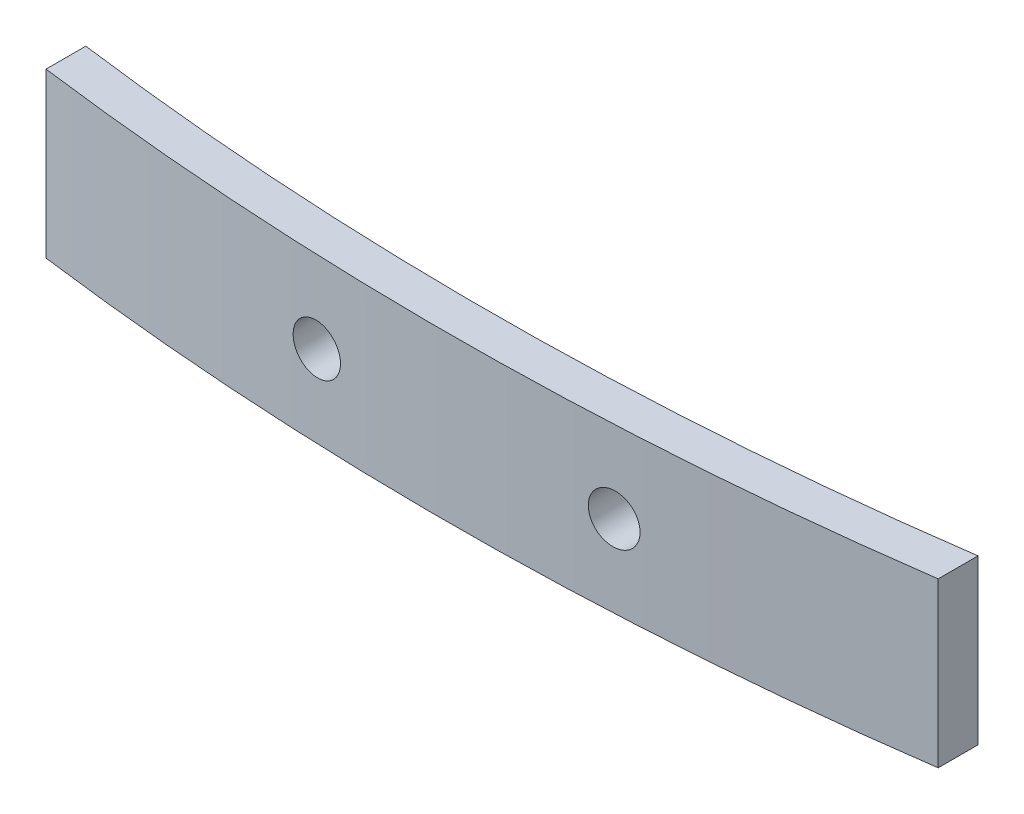
ISO-10303-21;
HEADER;
FILE_DESCRIPTION(('STEP AP214'),'2;1');
FILE_NAME('part.step','',(''),(''),'','','');
FILE_SCHEMA(('AUTOMOTIVE_DESIGN { 1 0 10303 214 1 1 1 1 }'));
ENDSEC;
DATA;
#1=APPLICATION_CONTEXT('core data for automotive mechanical design processes');
#2=APPLICATION_PROTOCOL_DEFINITION('international standard','automotive_design',2000,#1);
#3=PRODUCT_CONTEXT('',#1,'mechanical');
#4=PRODUCT('Part','Part','',(#3));
#5=PRODUCT_RELATED_PRODUCT_CATEGORY('part','',(#4));
#6=PRODUCT_DEFINITION_FORMATION('','',#4);
#7=PRODUCT_DEFINITION_CONTEXT('part definition',#1,'design');
#8=PRODUCT_DEFINITION('design','',#6,#7);
#9=PRODUCT_DEFINITION_SHAPE('','',#8);
#10=(LENGTH_UNIT() NAMED_UNIT(*) SI_UNIT(.MILLI.,.METRE.));
#11=(NAMED_UNIT(*) PLANE_ANGLE_UNIT() SI_UNIT($,.RADIAN.));
#12=(NAMED_UNIT(*) SI_UNIT($,.STERADIAN.) SOLID_ANGLE_UNIT());
#13=UNCERTAINTY_MEASURE_WITH_UNIT(LENGTH_MEASURE(1.E-05),#10,'distance_accuracy_value','');
#14=(GEOMETRIC_REPRESENTATION_CONTEXT(3) GLOBAL_UNCERTAINTY_ASSIGNED_CONTEXT((#13)) GLOBAL_UNIT_ASSIGNED_CONTEXT((#10,
#11,#12)) REPRESENTATION_CONTEXT('',''));
#15=CARTESIAN_POINT('',(0.,0.,0.));
#16=DIRECTION('',(0.,0.,1.));
#17=DIRECTION('',(1.,0.,0.));
#18=AXIS2_PLACEMENT_3D('',#15,#16,#17);
#19=CARTESIAN_POINT('',(-0.864955357142889,8.3,-164.510629845203));
#20=DIRECTION('',(0.,-1.,0.));
#21=DIRECTION('',(0.,0.,-1.));
#22=AXIS2_PLACEMENT_3D('',#19,#20,#21);
#23=CYLINDRICAL_SURFACE('',#22,165.210703971618);
#24=CARTESIAN_POINT('',(8.75,4.15,0.420050564105906));
#25=CARTESIAN_POINT('',(8.7499968756701,4.22012785151778,0.420050786641416));
#26=CARTESIAN_POINT('',(8.74407852912759,4.29030657591266,0.420396098331581));
#27=CARTESIAN_POINT('',(8.72055304510893,4.42872948848566,0.421764998652098));
#28=CARTESIAN_POINT('',(8.70293184075388,4.49697124536185,0.422789403552305));
#29=CARTESIAN_POINT('',(8.65650809093418,4.62949303841441,0.425475899042392));
#30=CARTESIAN_POINT('',(8.62771132313101,4.69377510184941,0.427137660119919));
#31=CARTESIAN_POINT('',(8.55976687690109,4.81657159404113,0.431033993499507));
#32=CARTESIAN_POINT('',(8.52062172919151,4.87508742814449,0.433268425749608));
#33=CARTESIAN_POINT('',(8.43305223614725,4.98477091182553,0.438227928441564));
#34=CARTESIAN_POINT('',(8.38461943762333,5.0359317924697,0.440953445708678));
#35=CARTESIAN_POINT('',(8.27987264209871,5.12940091687988,0.446793671892669));
#36=CARTESIAN_POINT('',(8.22355827497798,5.17170874467183,0.449908399086186));
#37=CARTESIAN_POINT('',(8.10455421106636,5.24633687235545,0.456421883334665));
#38=CARTESIAN_POINT('',(8.04185485362085,5.27864172993917,0.459821069355648));
#39=CARTESIAN_POINT('',(7.91193085692122,5.3322656283006,0.466784376452273));
#40=CARTESIAN_POINT('',(7.84470619336023,5.35358461006432,0.470348498413806));
#41=CARTESIAN_POINT('',(7.70755407236171,5.38465422269091,0.47753187341042));
#42=CARTESIAN_POINT('',(7.63762353654749,5.39439125228122,0.481151186219383));
#43=CARTESIAN_POINT('',(7.49711770071093,5.40197506678777,0.488331935567919));
#44=CARTESIAN_POINT('',(7.42654240018963,5.39982184250167,0.491893372062698));
#45=CARTESIAN_POINT('',(7.28673057784616,5.38368125095752,0.498859654116249));
#46=CARTESIAN_POINT('',(7.2174944251081,5.36969066742186,0.50226445685162));
#47=CARTESIAN_POINT('',(7.0823491009662,5.33026368881494,0.508828518634869));
#48=CARTESIAN_POINT('',(7.01643992557216,5.30482730747152,0.511987777977241));
#49=CARTESIAN_POINT('',(6.8898629668437,5.24324445263167,0.517984389992272));
#50=CARTESIAN_POINT('',(6.82919212444487,5.20710428528416,0.520821930848433));
#51=CARTESIAN_POINT('',(6.71477797427487,5.12513018115386,0.526116471355506));
#52=CARTESIAN_POINT('',(6.66103462822729,5.07929629793533,0.52857347310902));
#53=CARTESIAN_POINT('',(6.56206132205862,4.97928608662616,0.533057060848424));
#54=CARTESIAN_POINT('',(6.51682265931467,4.92511839069348,0.535084087092821));
#55=CARTESIAN_POINT('',(6.43608202244562,4.80994284773568,0.538675511251535));
#56=CARTESIAN_POINT('',(6.40057999610528,4.74893503739491,0.540239911646806));
#57=CARTESIAN_POINT('',(6.340357933409,4.62187706871117,0.542879900415455));
#58=CARTESIAN_POINT('',(6.31562712260273,4.55583202720676,0.543955977304391));
#59=CARTESIAN_POINT('',(6.27760214546197,4.42052190669178,0.545605857793076));
#60=CARTESIAN_POINT('',(6.26430793152615,4.35125684108483,0.546179663483375));
#61=CARTESIAN_POINT('',(6.24954097440456,4.21152203853996,0.546816834887879));
#62=CARTESIAN_POINT('',(6.24806041369155,4.14105312917926,0.546880538155648));
#63=CARTESIAN_POINT('',(6.25694243045685,4.00086716847885,0.546497531082771));
#64=CARTESIAN_POINT('',(6.26730498629387,3.93115011576549,0.546050821674816));
#65=CARTESIAN_POINT('',(6.29957441132196,3.79445965589939,0.544653251256617));
#66=CARTESIAN_POINT('',(6.3214792062226,3.72748575809605,0.543702480832502));
#67=CARTESIAN_POINT('',(6.37620694922726,3.59816781419316,0.541310528570389));
#68=CARTESIAN_POINT('',(6.40902990399195,3.5358237709181,0.539869346433213));
#69=CARTESIAN_POINT('',(6.48467114761501,3.4175119277289,0.536518343609078));
#70=CARTESIAN_POINT('',(6.52749274492063,3.36154624749035,0.534608367792417));
#71=CARTESIAN_POINT('',(6.62190587875572,3.25759845060247,0.530352467316842));
#72=CARTESIAN_POINT('',(6.6734974488955,3.2096163645511,0.528006540987174));
#73=CARTESIAN_POINT('',(6.78402732919472,3.1229563323932,0.522920767674274));
#74=CARTESIAN_POINT('',(6.8429713797798,3.08428572609344,0.520180612638965));
#75=CARTESIAN_POINT('',(6.96649912462997,3.01738774672038,0.51436476411554));
#76=CARTESIAN_POINT('',(7.03108284432829,2.98916042074618,0.511289069114225));
#77=CARTESIAN_POINT('',(7.16412839034453,2.94391857326429,0.504869298035268));
#78=CARTESIAN_POINT('',(7.23259422327701,2.92691587381022,0.501524943142095));
#79=CARTESIAN_POINT('',(7.37140001377697,2.90464748821122,0.494654869625039));
#80=CARTESIAN_POINT('',(7.44173998602875,2.89938189405638,0.491129149579919));
#81=CARTESIAN_POINT('',(7.58236818374903,2.90073434853974,0.483989440786617));
#82=CARTESIAN_POINT('',(7.65265629683359,2.90736367487349,0.480375371478415));
#83=CARTESIAN_POINT('',(7.79112055707237,2.9323391674771,0.473168949725147));
#84=CARTESIAN_POINT('',(7.85929669259729,2.95068539825232,0.469576597399751));
#85=CARTESIAN_POINT('',(7.99162839490877,2.99858567305698,0.462525628244137));
#86=CARTESIAN_POINT('',(8.05578240324823,3.02814403053687,0.459067063448728));
#87=CARTESIAN_POINT('',(8.17821506459887,3.09763191261792,0.452400980172807));
#88=CARTESIAN_POINT('',(8.23649395687128,3.13756101463856,0.449193451470163));
#89=CARTESIAN_POINT('',(8.34548259383017,3.22663160990741,0.44314404983962));
#90=CARTESIAN_POINT('',(8.39619733991694,3.27576696706239,0.440301935473492));
#91=CARTESIAN_POINT('',(8.4886680570718,3.38189249727254,0.435084215694027));
#92=CARTESIAN_POINT('',(8.5304218580004,3.43888456757103,0.432708723297817));
#93=CARTESIAN_POINT('',(8.60372478212185,3.55903320833602,0.428516976642923));
#94=CARTESIAN_POINT('',(8.6352829269122,3.62218426425832,0.426700228050152));
#95=CARTESIAN_POINT('',(8.68731128395109,3.75285295151056,0.423695249568868));
#96=CARTESIAN_POINT('',(8.70779492398493,3.82036518318595,0.422506258568424));
#97=CARTESIAN_POINT('',(8.73161237551989,3.93192617529781,0.421121713201919));
#98=CARTESIAN_POINT('',(8.73849904429465,3.97524605096882,0.420720697745676));
#99=CARTESIAN_POINT('',(8.74769383053028,4.06237066227353,0.420185053794028));
#100=CARTESIAN_POINT('',(8.75000195246986,4.1061753974329,0.420050425038045));
#101=CARTESIAN_POINT('',(8.75,4.15,0.420050564105906));
#102=B_SPLINE_CURVE_WITH_KNOTS('',3,(#24,#25,#26,#27,#28,#29,#30,#31,#32,#33,#34,#35,#36,#37,
#38,#39,#40,#41,#42,#43,#44,#45,#46,#47,#48,#49,#50,#51,#52,#53,#54,#55,#56,#57,#58,#59,#60,#61,
#62,#63,#64,#65,#66,#67,#68,#69,#70,#71,#72,#73,#74,#75,#76,#77,#78,#79,#80,#81,#82,#83,#84,#85,
#86,#87,#88,#89,#90,#91,#92,#93,#94,#95,#96,#97,#98,#99,#100,#101),.UNSPECIFIED.,.T.,.F.,(4,2,2,
2,2,2,2,2,2,2,2,2,2,2,2,2,2,2,2,2,2,2,2,2,2,2,2,2,2,2,2,2,2,2,2,2,2,2,4),(0.,0.210223445977021,
0.420700039769353,0.631067963784939,0.841384489415681,1.0518933518043,1.26241210304977,
1.47325424539596,1.68409752033319,1.89518815550945,2.10627895405728,2.31742712559702,
2.52857504389096,2.73959881074264,2.95062141157759,3.16142688888051,3.37223123566221,
3.58282422776111,3.79341634332708,4.00386909080652,4.21432145372016,4.42473600850072,
4.63515069164558,4.84563509774261,5.05612031052455,5.26677089982141,5.47742243913898,
5.68829548939093,5.89917019236428,6.11024493345311,6.32132083658665,6.53247802584897,
6.74362661236154,6.95463496292118,7.16569435743921,7.37656648187793,7.58718234815398,
7.71855622861525,7.84992998056732),.UNSPECIFIED.);
#103=CARTESIAN_POINT('',(8.75,4.15,0.420050564105906));
#104=VERTEX_POINT('',#103);
#105=EDGE_CURVE('E120',#104,#104,#102,.T.);
#106=ORIENTED_EDGE('',*,*,#105,.T.);
#107=EDGE_LOOP('',(#106));
#108=FACE_BOUND('',#107,.T.);
#109=CARTESIAN_POINT('',(-6.25,4.15,0.612288009926604));
#110=CARTESIAN_POINT('',(-6.25000311571131,4.22018355239191,0.612287948701828));
#111=CARTESIAN_POINT('',(-6.25593075978931,4.2904179787371,0.612094924403045));
#112=CARTESIAN_POINT('',(-6.27949447756528,4.42895209563306,0.611323893589454));
#113=CARTESIAN_POINT('',(-6.2971446367521,4.49724935546489,0.610745423930159));
#114=CARTESIAN_POINT('',(-6.34364908837448,4.62988168369549,0.609208938538244));
#115=CARTESIAN_POINT('',(-6.37249792853421,4.69421866259394,0.60825110749982));
#116=CARTESIAN_POINT('',(-6.44057119968027,4.81711670051832,0.605966440329405));
#117=CARTESIAN_POINT('',(-6.47979305791574,4.87567918681573,0.60463969569242));
#118=CARTESIAN_POINT('',(-6.56751337852462,4.9854062839793,0.601633356485878));
#119=CARTESIAN_POINT('',(-6.61601467183209,5.03656862885316,0.599953654221964));
#120=CARTESIAN_POINT('',(-6.72090916987377,5.13002658482638,0.596266618886532));
#121=CARTESIAN_POINT('',(-6.77730270118661,5.17232182882653,0.594259272256609));
#122=CARTESIAN_POINT('',(-6.89640796884524,5.24686589631549,0.589951115896844));
#123=CARTESIAN_POINT('',(-6.95912282670767,5.27910972386023,0.587650161030504));
#124=CARTESIAN_POINT('',(-7.08906630444559,5.3326117277739,0.582802406813894));
#125=CARTESIAN_POINT('',(-7.15629493167516,5.35386988624392,0.580255607063078));
#126=CARTESIAN_POINT('',(-7.29340442194187,5.38481197096959,0.574973575011229));
#127=CARTESIAN_POINT('',(-7.36328700154222,5.39448826991545,0.572238219788182));
#128=CARTESIAN_POINT('',(-7.50368007668842,5.4019696691906,0.56665198267269));
#129=CARTESIAN_POINT('',(-7.57419057342636,5.39977474697769,0.563801100560882));
#130=CARTESIAN_POINT('',(-7.71387945362295,5.38357292521863,0.558064449045412));
#131=CARTESIAN_POINT('',(-7.78305707886924,5.36955949439595,0.555178661221106));
#132=CARTESIAN_POINT('',(-7.91807733611011,5.33010934361725,0.549464502868027));
#133=CARTESIAN_POINT('',(-7.98391995872912,5.30467259154922,0.546636132500682));
#134=CARTESIAN_POINT('',(-8.11040870949573,5.24309180134629,0.54113211185841));
#135=CARTESIAN_POINT('',(-8.17105421102282,5.20694647440621,0.538456480012221));
#136=CARTESIAN_POINT('',(-8.28541568787778,5.12497267595302,0.533354465386389));
#137=CARTESIAN_POINT('',(-8.33913167949136,5.07914422719782,0.530928082020964));
#138=CARTESIAN_POINT('',(-8.43807894852099,4.97912832988149,0.526417399872258));
#139=CARTESIAN_POINT('',(-8.48331455816759,4.92494517527411,0.524332926491592));
#140=CARTESIAN_POINT('',(-8.56404495416109,4.80973912005988,0.520586488920757));
#141=CARTESIAN_POINT('',(-8.59953979122227,4.74871625506557,0.518924522530854));
#142=CARTESIAN_POINT('',(-8.65974439972634,4.6216271240783,0.516091877374447));
#143=CARTESIAN_POINT('',(-8.68446475412751,4.55556588220122,0.514920716570525));
#144=CARTESIAN_POINT('',(-8.72246441910089,4.42022399273247,0.513115788962741));
#145=CARTESIAN_POINT('',(-8.73574379707123,4.35094336410855,0.512482018993142));
#146=CARTESIAN_POINT('',(-8.75047458862379,4.2111980915843,0.511778780959092));
#147=CARTESIAN_POINT('',(-8.75193694008761,4.14073460310762,0.511708791058003));
#148=CARTESIAN_POINT('',(-8.74302066539331,4.0005626973153,0.512134684324352));
#149=CARTESIAN_POINT('',(-8.73264207065434,3.93085427799663,0.512630565990288));
#150=CARTESIAN_POINT('',(-8.70034544962065,3.79419204857333,0.514167162544728));
#151=CARTESIAN_POINT('',(-8.67843080347073,3.7272374377756,0.515207717839497));
#152=CARTESIAN_POINT('',(-8.62368951853576,3.59795898046812,0.517790426931301));
#153=CARTESIAN_POINT('',(-8.5908628581906,3.5356351431082,0.519332581719403));
#154=CARTESIAN_POINT('',(-8.51521227384373,3.41735055124752,0.522856772119375));
#155=CARTESIAN_POINT('',(-8.47238306461757,3.36139318403883,0.524839040254345));
#156=CARTESIAN_POINT('',(-8.3779548356778,3.25746147580423,0.52916466983499));
#157=CARTESIAN_POINT('',(-8.32635576524137,3.20948718095373,0.53150803336915));
#158=CARTESIAN_POINT('',(-8.21579579794787,3.12283180802716,0.536469223168007));
#159=CARTESIAN_POINT('',(-8.15682751540769,3.08416016875794,0.539087324356433));
#160=CARTESIAN_POINT('',(-8.03324331961947,3.01726497292627,0.544500869169606));
#161=CARTESIAN_POINT('',(-7.96862738257522,2.98904146038931,0.547296313541571));
#162=CARTESIAN_POINT('',(-7.8355196571947,2.94381943465548,0.552971163005119));
#163=CARTESIAN_POINT('',(-7.76702449530367,2.92683085980956,0.555850640087178));
#164=CARTESIAN_POINT('',(-7.62815314481567,2.90459979079998,0.561598861621527));
#165=CARTESIAN_POINT('',(-7.55777694822369,2.89935734656927,0.564467606028139));
#166=CARTESIAN_POINT('',(-7.41711753048462,2.90076871395252,0.570110501825143));
#167=CARTESIAN_POINT('',(-7.34683434598474,2.90742630602083,0.572884622869854));
#168=CARTESIAN_POINT('',(-7.20837958754747,2.93245878709451,0.578262808404097));
#169=CARTESIAN_POINT('',(-7.14020801585102,2.95083368853438,0.580866872713159));
#170=CARTESIAN_POINT('',(-7.00793228027882,2.99877590873363,0.58584172349279));
#171=CARTESIAN_POINT('',(-6.94382705094201,3.02834028137105,0.588212571161087));
#172=CARTESIAN_POINT('',(-6.82149085700398,3.09782436801472,0.592671585008922));
#173=CARTESIAN_POINT('',(-6.76325964443876,3.13774364464784,0.59475976312226));
#174=CARTESIAN_POINT('',(-6.65436671082572,3.22677356012875,0.598613974910899));
#175=CARTESIAN_POINT('',(-6.60369956033725,3.27587754864781,0.600380239856701));
#176=CARTESIAN_POINT('',(-6.51131557625305,3.38191903380727,0.603565383454531));
#177=CARTESIAN_POINT('',(-6.46960094041181,3.43885844835036,0.604984176817734));
#178=CARTESIAN_POINT('',(-6.39633408535729,3.55892548464134,0.607454882195929));
#179=CARTESIAN_POINT('',(-6.36478028832285,3.62205214361811,0.60850685117518));
#180=CARTESIAN_POINT('',(-6.31275419768299,3.75266197816612,0.610231582461445));
#181=CARTESIAN_POINT('',(-6.29226858560104,3.82013980793337,0.610904800564298));
#182=CARTESIAN_POINT('',(-6.26842481149668,3.93170707646447,0.611686340087224));
#183=CARTESIAN_POINT('',(-6.26152415895528,3.9750705609376,0.61191184300066));
#184=CARTESIAN_POINT('',(-6.25231078003501,4.06228273831287,0.612212697036008));
#185=CARTESIAN_POINT('',(-6.24999805250957,4.10613143109375,0.612288048195446));
#186=CARTESIAN_POINT('',(-6.25,4.15,0.612288009926604));
#187=B_SPLINE_CURVE_WITH_KNOTS('',3,(#109,#110,#111,#112,#113,#114,#115,#116,#117,#118,#119,
#120,#121,#122,#123,#124,#125,#126,#127,#128,#129,#130,#131,#132,#133,#134,#135,#136,#137,#138,
#139,#140,#141,#142,#143,#144,#145,#146,#147,#148,#149,#150,#151,#152,#153,#154,#155,#156,#157,
#158,#159,#160,#161,#162,#163,#164,#165,#166,#167,#168,#169,#170,#171,#172,#173,#174,#175,#176,
#177,#178,#179,#180,#181,#182,#183,#184,#185,#186),.UNSPECIFIED.,.T.,.F.,(4,2,2,2,2,2,2,2,2,2,2,
2,2,2,2,2,2,2,2,2,2,2,2,2,2,2,2,2,2,2,2,2,2,2,2,2,2,2,4),(0.,0.210390503068588,
0.421034264711717,0.631575599082519,0.842064763174761,1.05261824517612,1.26318044240039,
1.47384713095046,1.68451416273795,1.89531985448584,2.10612594653145,2.3170486129942,
2.52797187238342,2.7389205272615,2.94986868635966,3.16070878649296,3.3715477888891,
3.58217923083019,3.79280943194546,4.00324465064315,4.21367931096638,4.42405234673518,
4.63442579816419,4.84491066085422,5.05539674098095,5.26609549541984,5.47679513767428,
5.6876809150019,5.89856758880574,6.10952126989617,6.32047517485255,6.53137357548215,
6.74226306958042,6.95300045295797,7.1637895112675,7.37454582149352,7.58504795814686,
7.71655359263121,7.8480591942506),.UNSPECIFIED.);
#188=CARTESIAN_POINT('',(-6.25,4.15,0.612288009926604));
#189=VERTEX_POINT('',#188);
#190=EDGE_CURVE('E137',#189,#189,#187,.T.);
#191=ORIENTED_EDGE('',*,*,#190,.T.);
#192=EDGE_LOOP('',(#191));
#193=FACE_BOUND('',#192,.T.);
#194=CARTESIAN_POINT('',(-0.864955357142889,0.,-164.510629845203));
#195=DIRECTION('',(0.,-1.,0.));
#196=DIRECTION('',(0.,0.,1.));
#197=AXIS2_PLACEMENT_3D('',#194,#195,#196);
#198=CIRCLE('',#197,165.210703971618);
#199=CARTESIAN_POINT('',(22.5,0.,-0.960467607569709));
#200=VERTEX_POINT('',#199);
#201=CARTESIAN_POINT('',(-22.5,0.,-0.722652416763447));
#202=VERTEX_POINT('',#201);
#203=EDGE_CURVE('E116',#200,#202,#198,.T.);
#204=ORIENTED_EDGE('',*,*,#203,.T.);
#205=DIRECTION('',(0.,-1.,0.));
#206=VECTOR('',#205,1.);
#207=CARTESIAN_POINT('',(-22.5,8.3,-0.722652416763447));
#208=LINE('',#207,#206);
#209=CARTESIAN_POINT('',(-22.5,8.3,-0.722652416763447));
#210=VERTEX_POINT('',#209);
#211=EDGE_CURVE('E11',#210,#202,#208,.T.);
#212=ORIENTED_EDGE('',*,*,#211,.F.);
#213=CARTESIAN_POINT('',(-0.864955357142889,8.3,-164.510629845203));
#214=DIRECTION('',(0.,-1.,0.));
#215=DIRECTION('',(0.,0.,1.));
#216=AXIS2_PLACEMENT_3D('',#213,#214,#215);
#217=CIRCLE('',#216,165.210703971618);
#218=CARTESIAN_POINT('',(22.5,8.3,-0.960467607569709));
#219=VERTEX_POINT('',#218);
#220=EDGE_CURVE('E99',#219,#210,#217,.T.);
#221=ORIENTED_EDGE('',*,*,#220,.F.);
#222=DIRECTION('',(0.,-1.,0.));
#223=VECTOR('',#222,1.);
#224=CARTESIAN_POINT('',(22.5,8.3,-0.960467607569709));
#225=LINE('',#224,#223);
#226=EDGE_CURVE('E112',#219,#200,#225,.T.);
#227=ORIENTED_EDGE('',*,*,#226,.T.);
#228=EDGE_LOOP('',(#204,#212,#221,#227));
#229=FACE_BOUND('',#228,.T.);
#230=ADVANCED_FACE('F39',(#108,#193,#229),#23,.F.);
#231=CARTESIAN_POINT('',(-22.5,8.3,-0.722652416763447));
#232=DIRECTION('',(1.,0.,0.));
#233=DIRECTION('',(0.,0.,-1.));
#234=AXIS2_PLACEMENT_3D('',#231,#232,#233);
#235=PLANE('',#234);
#236=DIRECTION('',(0.,0.,1.));
#237=VECTOR('',#236,1.);
#238=CARTESIAN_POINT('',(-22.5,0.,-0.722652416763447));
#239=LINE('',#238,#237);
#240=CARTESIAN_POINT('',(-22.5000000000001,0.,1.29450990017857));
#241=VERTEX_POINT('',#240);
#242=EDGE_CURVE('E104',#202,#241,#239,.T.);
#243=ORIENTED_EDGE('',*,*,#242,.T.);
#244=DIRECTION('',(0.,-1.,0.));
#245=VECTOR('',#244,1.);
#246=CARTESIAN_POINT('',(-22.5000000000001,8.3,1.29450990017857));
#247=LINE('',#246,#245);
#248=CARTESIAN_POINT('',(-22.5000000000001,8.3,1.29450990017857));
#249=VERTEX_POINT('',#248);
#250=EDGE_CURVE('E55',#249,#241,#247,.T.);
#251=ORIENTED_EDGE('',*,*,#250,.F.);
#252=DIRECTION('',(0.,0.,1.));
#253=VECTOR('',#252,1.);
#254=CARTESIAN_POINT('',(-22.5,8.3,-0.722652416763447));
#255=LINE('',#254,#253);
#256=EDGE_CURVE('E94',#210,#249,#255,.T.);
#257=ORIENTED_EDGE('',*,*,#256,.F.);
#258=ORIENTED_EDGE('',*,*,#211,.T.);
#259=EDGE_LOOP('',(#243,#251,#257,#258));
#260=FACE_BOUND('',#259,.T.);
#261=ADVANCED_FACE('F103',(#260),#235,.F.);
#262=CARTESIAN_POINT('',(-0.864955357142889,8.3,-164.510629845203));
#263=DIRECTION('',(0.,-1.,0.));
#264=DIRECTION('',(0.,0.,-1.));
#265=AXIS2_PLACEMENT_3D('',#262,#263,#264);
#266=CYLINDRICAL_SURFACE('',#265,167.210703971618);
#267=CARTESIAN_POINT('',(8.75,4.15,2.42340549859404));
#268=CARTESIAN_POINT('',(8.7499968759262,4.07987012137044,2.42340571844586));
#269=CARTESIAN_POINT('',(8.74407819084325,4.00968936898739,2.42374690560115));
#270=CARTESIAN_POINT('',(8.72055131717487,3.87126241398294,2.42509945786627));
#271=CARTESIAN_POINT('',(8.70292906080826,3.80301864269076,2.42611162950184));
#272=CARTESIAN_POINT('',(8.65650238633006,3.67049285173357,2.4287660522962));
#273=CARTESIAN_POINT('',(8.62770373590653,3.60620880840686,2.43040797845888));
#274=CARTESIAN_POINT('',(8.55975462355993,3.48340863823658,2.43425781776976));
#275=CARTESIAN_POINT('',(8.52060669359667,3.42489110541184,2.43646559247862));
#276=CARTESIAN_POINT('',(8.43303156162517,3.31520582991078,2.44136589382248));
#277=CARTESIAN_POINT('',(8.38459608361104,3.26404471412625,2.44405885266811));
#278=CARTESIAN_POINT('',(8.27984339346623,3.17057563894572,2.44982931904001));
#279=CARTESIAN_POINT('',(8.22352581262794,3.12826809393164,2.45290684455476));
#280=CARTESIAN_POINT('',(8.10451714174231,3.05364269118637,2.45934241559074));
#281=CARTESIAN_POINT('',(8.041816623435,3.02133990455394,2.46270087473628));
#282=CARTESIAN_POINT('',(7.91189047346441,2.96772029239522,2.46958074239435));
#283=CARTESIAN_POINT('',(7.84466481828969,2.9464035239544,2.4731021517535));
#284=CARTESIAN_POINT('',(7.70751294966958,2.91533895910661,2.48019932744157));
#285=CARTESIAN_POINT('',(7.63758373153518,2.90560444024127,2.48377515140502));
#286=CARTESIAN_POINT('',(7.49708099898386,2.89802511241837,2.49086960284267));
#287=CARTESIAN_POINT('',(7.42650748410816,2.90018031192793,2.49438823027613));
#288=CARTESIAN_POINT('',(7.28670012554887,2.91632414244071,2.50127073842057));
#289=CARTESIAN_POINT('',(7.21746664220022,2.93031591229712,2.50463457783493));
#290=CARTESIAN_POINT('',(7.08232692497333,2.96974430691074,2.51111965594278));
#291=CARTESIAN_POINT('',(7.01642068728273,2.99518091855414,2.51424089491422));
#292=CARTESIAN_POINT('',(6.88984875734409,3.05676359416933,2.520165375863));
#293=CARTESIAN_POINT('',(6.82918007858731,3.09290350222251,2.52296879935137));
#294=CARTESIAN_POINT('',(6.71477020629758,3.17487622745391,2.52819967652553));
#295=CARTESIAN_POINT('',(6.66102897533549,3.22070899225789,2.53062713224269));
#296=CARTESIAN_POINT('',(6.56205835230829,3.32071733576925,2.53505686160251));
#297=CARTESIAN_POINT('',(6.51682046506705,3.37488448861664,2.5370595598542));
#298=CARTESIAN_POINT('',(6.43608126204884,3.49005848772344,2.54060787994089));
#299=CARTESIAN_POINT('',(6.40057989533456,3.55106529819833,2.54215350416711));
#300=CARTESIAN_POINT('',(6.34035812216982,3.67812241017294,2.54476184415459));
#301=CARTESIAN_POINT('',(6.31562719806153,3.7441677170099,2.545825031073));
#302=CARTESIAN_POINT('',(6.2776020971927,3.87947825233901,2.54745514622849));
#303=CARTESIAN_POINT('',(6.26430787395331,3.94874346774423,2.54802207648237));
#304=CARTESIAN_POINT('',(6.24954082405741,4.08847961995922,2.54865161672816));
#305=CARTESIAN_POINT('',(6.24806036595877,4.15894974892714,2.54871455229005));
#306=CARTESIAN_POINT('',(6.25694299560165,4.29913811959953,2.54833610858745));
#307=CARTESIAN_POINT('',(6.2673060622287,4.36885636264422,2.54789473022203));
#308=CARTESIAN_POINT('',(6.29957701281969,4.50554944308895,2.54651384125092));
#309=CARTESIAN_POINT('',(6.321482871838,4.57252475945876,2.54557441801678));
#310=CARTESIAN_POINT('',(6.3762133200028,4.70184538321581,2.54321101100255));
#311=CARTESIAN_POINT('',(6.40903791561766,4.76419068786017,2.54178702693539));
#312=CARTESIAN_POINT('',(6.48468275935071,4.88250430561796,2.53847602046889));
#313=CARTESIAN_POINT('',(6.52750623741589,4.9384705493861,2.53658884843546));
#314=CARTESIAN_POINT('',(6.6219236312372,5.04241915222049,2.5323837556043));
#315=CARTESIAN_POINT('',(6.67351757989245,5.09040148133676,2.53006583319077));
#316=CARTESIAN_POINT('',(6.78405166747195,5.17706068505861,2.5250408107236));
#317=CARTESIAN_POINT('',(6.84299741070677,5.21573039397913,2.52233341352717));
#318=CARTESIAN_POINT('',(6.96652874466183,5.28262627072503,2.51658709195815));
#319=CARTESIAN_POINT('',(7.03111436007255,5.31085239282717,2.51354816613418));
#320=CARTESIAN_POINT('',(7.16416214246729,5.35609080416202,2.5072052239132));
#321=CARTESIAN_POINT('',(7.23262822078288,5.37309155233608,2.50390093859557));
#322=CARTESIAN_POINT('',(7.37143437970746,5.39535605206446,2.49711318891029));
#323=CARTESIAN_POINT('',(7.44177447473131,5.40061971331127,2.4936297231642));
#324=CARTESIAN_POINT('',(7.58240109739181,5.39926339313341,2.4865756781979));
#325=CARTESIAN_POINT('',(7.65268751511746,5.39263240341705,2.48300502130082));
#326=CARTESIAN_POINT('',(7.79114816585301,5.36765414255638,2.4758851856896));
#327=CARTESIAN_POINT('',(7.8593223874094,5.34930680789114,2.47233600709201));
#328=CARTESIAN_POINT('',(7.99164948058038,5.30140518650286,2.46536983325012));
#329=CARTESIAN_POINT('',(8.05580082929915,5.27184668517906,2.46195288824925));
#330=CARTESIAN_POINT('',(8.17822818102457,5.20235946919012,2.45536704386846));
#331=CARTESIAN_POINT('',(8.23650442308893,5.16243117670771,2.45219813439716));
#332=CARTESIAN_POINT('',(8.34548871241756,5.07336264520676,2.44622154154587));
#333=CARTESIAN_POINT('',(8.39620166121003,5.02422841925977,2.44341362438257));
#334=CARTESIAN_POINT('',(8.48866906289056,4.91810600261773,2.43825869201559));
#335=CARTESIAN_POINT('',(8.53042134428022,4.86111591364173,2.43591178854408));
#336=CARTESIAN_POINT('',(8.60372300458297,4.74097006582692,2.43177041236711));
#337=CARTESIAN_POINT('',(8.63528107441361,4.67781961903462,2.42997546915954));
#338=CARTESIAN_POINT('',(8.68730942116913,4.5471524942547,2.42700655200384));
#339=CARTESIAN_POINT('',(8.70779312246654,4.47964121417121,2.42583182626751));
#340=CARTESIAN_POINT('',(8.73161132337617,4.36808002854529,2.42446385353792));
#341=CARTESIAN_POINT('',(8.7384983882257,4.32475891370707,2.42406762781939));
#342=CARTESIAN_POINT('',(8.74769370050571,4.23763182151305,2.42353838177779));
#343=CARTESIAN_POINT('',(8.75000195230871,4.1938258446203,2.42340536120337));
#344=CARTESIAN_POINT('',(8.75,4.15,2.42340549859404));
#345=B_SPLINE_CURVE_WITH_KNOTS('',3,(#267,#268,#269,#270,#271,#272,#273,#274,#275,#276,#277,
#278,#279,#280,#281,#282,#283,#284,#285,#286,#287,#288,#289,#290,#291,#292,#293,#294,#295,#296,
#297,#298,#299,#300,#301,#302,#303,#304,#305,#306,#307,#308,#309,#310,#311,#312,#313,#314,#315,
#316,#317,#318,#319,#320,#321,#322,#323,#324,#325,#326,#327,#328,#329,#330,#331,#332,#333,#334,
#335,#336,#337,#338,#339,#340,#341,#342,#343,#344),.UNSPECIFIED.,.T.,.F.,(4,2,2,2,2,2,2,2,2,2,2,
2,2,2,2,2,2,2,2,2,2,2,2,2,2,2,2,2,2,2,2,2,2,2,2,2,2,2,4),(0.,0.210229526330766,
0.420712208603477,0.631086413349325,0.841409197426138,1.05192027556956,1.26244120425612,
1.47327773487148,1.684115361023,1.89519445291078,2.10627369511606,2.31740892942866,
2.52854392181756,2.7395577165822,2.95057037118733,3.16137108216245,3.37217069029722,
3.58276398222082,3.79335641828739,4.00381280507794,4.21426881667042,4.42468792036777,
4.63510714871938,4.84559444323099,5.0560825273238,5.26673205968139,5.47738251427596,
5.68824920749127,5.89911752315157,6.11018109445236,6.32124581005774,6.53238994974381,
6.74352549451836,6.95452360890834,7.16557279828773,7.37644158314923,7.58705417601551,
7.71843177902917,7.84980925658394),.UNSPECIFIED.);
#346=CARTESIAN_POINT('',(8.75,4.15,2.42340549859404));
#347=VERTEX_POINT('',#346);
#348=EDGE_CURVE('E43',#347,#347,#345,.T.);
#349=ORIENTED_EDGE('',*,*,#348,.T.);
#350=EDGE_LOOP('',(#349));
#351=FACE_BOUND('',#350,.T.);
#352=CARTESIAN_POINT('',(-6.25,4.15,2.61333856411394));
#353=CARTESIAN_POINT('',(-6.25000311565992,4.07981574606103,2.61333850362469));
#354=CARTESIAN_POINT('',(-6.25593087719105,4.00958061729741,2.61314778671223));
#355=CARTESIAN_POINT('',(-6.27949507550797,3.87104510438208,2.61238597227617));
#356=CARTESIAN_POINT('',(-6.297145598251,3.80274715099205,2.61181441713833));
#357=CARTESIAN_POINT('',(-6.34365105592586,3.67011345543528,2.61029629603647));
#358=CARTESIAN_POINT('',(-6.37250054084197,3.60577580359118,2.60934991247952));
#359=CARTESIAN_POINT('',(-6.44057541610514,3.48287650486345,2.60709254775912));
#360=CARTESIAN_POINT('',(-6.4797982334516,3.42431343059236,2.60578165700387));
#361=CARTESIAN_POINT('',(-6.56752060650743,3.31458558372347,2.60281124515757));
#362=CARTESIAN_POINT('',(-6.61602294900017,3.26342304174475,2.60115161932128));
#363=CARTESIAN_POINT('',(-6.72091982579359,3.169964875977,2.5975086494016));
#364=CARTESIAN_POINT('',(-6.77731468628578,3.12766961884637,2.59552529193808));
#365=CARTESIAN_POINT('',(-6.89642214749191,3.05312628172291,2.59126864347545));
#366=CARTESIAN_POINT('',(-6.95913779281653,3.02088307452851,2.58899521261149));
#367=CARTESIAN_POINT('',(-7.08908295006164,2.96738245851538,2.58420544720455));
#368=CARTESIAN_POINT('',(-7.15631246894652,2.94612506664691,2.58168911228679));
#369=CARTESIAN_POINT('',(-7.2934227128282,2.91518499163511,2.5764703066392));
#370=CARTESIAN_POINT('',(-7.36330511368689,2.90550975498857,2.57376771734056));
#371=CARTESIAN_POINT('',(-7.50369776502639,2.89803039840271,2.56824840244642));
#372=CARTESIAN_POINT('',(-7.57420801664396,2.90022629996097,2.56543167664425));
#373=CARTESIAN_POINT('',(-7.71389536100917,2.91642989677656,2.55976380259775));
#374=CARTESIAN_POINT('',(-7.78307171352842,2.93044396776616,2.55691263659198));
#375=CARTESIAN_POINT('',(-7.91808934889109,2.96989498022109,2.55126704410276));
#376=CARTESIAN_POINT('',(-7.98393062249905,2.99533195331666,2.54847261777646));
#377=CARTESIAN_POINT('',(-8.11041645198137,3.05691261500473,2.54303467145691));
#378=CARTESIAN_POINT('',(-8.17106039634818,3.09305756125267,2.54039116923328));
#379=CARTESIAN_POINT('',(-8.28541885549217,3.175029992563,2.53535042867961));
#380=CARTESIAN_POINT('',(-8.33913338623508,3.22085745531573,2.53295318978217));
#381=CARTESIAN_POINT('',(-8.43807859434589,3.32087135476026,2.5284966624215));
#382=CARTESIAN_POINT('',(-8.48331350090785,3.37505359981428,2.52643720555466));
#383=CARTESIAN_POINT('',(-8.56404270602494,3.49025738791354,2.52273572913799));
#384=CARTESIAN_POINT('',(-8.59953705405136,3.55127889622065,2.52109370746804));
#385=CARTESIAN_POINT('',(-8.65974178650218,3.67836643118199,2.51829501245051));
#386=CARTESIAN_POINT('',(-8.68446250170708,3.74442755361697,2.51713787419193));
#387=CARTESIAN_POINT('',(-8.72246289000835,3.87976910315633,2.51535454955887));
#388=CARTESIAN_POINT('',(-8.73574262890663,3.94904951174283,2.51472836013067));
#389=CARTESIAN_POINT('',(-8.7504743705803,4.08879588610972,2.51403350758343));
#390=CARTESIAN_POINT('',(-8.75193705084305,4.15926072396618,2.51396434115775));
#391=CARTESIAN_POINT('',(-8.74302097445947,4.29943537547764,2.51438511956936));
#392=CARTESIAN_POINT('',(-8.73264224847514,4.36914519108721,2.51487506295889));
#393=CARTESIAN_POINT('',(-8.70034474469929,4.50581071281282,2.51639328094994));
#394=CARTESIAN_POINT('',(-8.67842926680251,4.57276720057096,2.51742140161439));
#395=CARTESIAN_POINT('',(-8.62368559505439,4.70204927590946,2.51997326186475));
#396=CARTESIAN_POINT('',(-8.59085738018815,4.76437485457169,2.52149700240508));
#397=CARTESIAN_POINT('',(-8.51520341465857,4.88266186717285,2.52497910253712));
#398=CARTESIAN_POINT('',(-8.47237250426532,4.93861999433292,2.52693768640997));
#399=CARTESIAN_POINT('',(-8.37794037154417,5.04255288839341,2.53121164028211));
#400=CARTESIAN_POINT('',(-8.32633909960902,5.09052761013476,2.53352701229948));
#401=CARTESIAN_POINT('',(-8.21577563837456,5.17718226167879,2.53842888642847));
#402=CARTESIAN_POINT('',(-8.15680623875195,5.21585297678,2.54101565371978));
#403=CARTESIAN_POINT('',(-8.03321979513085,5.28274613144361,2.54636440600295));
#404=CARTESIAN_POINT('',(-7.96860272804309,5.31096852828781,2.54912639171115));
#405=CARTESIAN_POINT('',(-7.83549424666815,5.3561875837718,2.55473325469572));
#406=CARTESIAN_POINT('',(-7.76699953930919,5.37317454066665,2.55757820140137));
#407=CARTESIAN_POINT('',(-7.62812938553602,5.39540260675064,2.56325748378831));
#408=CARTESIAN_POINT('',(-7.55775393123791,5.40064366669441,2.56609181942506));
#409=CARTESIAN_POINT('',(-7.41709683864988,5.39922983344184,2.57166700330105));
#410=CARTESIAN_POINT('',(-7.34681523622105,5.39257125069326,2.57440782227638));
#411=CARTESIAN_POINT('',(-7.20836386994777,5.36753735918785,2.57972143960436));
#412=CARTESIAN_POINT('',(-7.14019410839206,5.34916203773327,2.58229423777492));
#413=CARTESIAN_POINT('',(-7.00792165421107,5.30121947308366,2.58720937043567));
#414=CARTESIAN_POINT('',(-6.94381792318053,5.27165510095635,2.58955176385274));
#415=CARTESIAN_POINT('',(-6.8214847420781,5.20217159213611,2.59395725996007));
#416=CARTESIAN_POINT('',(-6.76325504445718,5.16225289205843,2.59602037442122));
#417=CARTESIAN_POINT('',(-6.65436417618515,5.07322407013564,2.59982835513281));
#418=CARTESIAN_POINT('',(-6.60369768662673,5.02412046295314,2.60157344522986));
#419=CARTESIAN_POINT('',(-6.511314947515,4.91808008217984,2.60472040388598));
#420=CARTESIAN_POINT('',(-6.46960089641142,4.86114139014878,2.60612218815137));
#421=CARTESIAN_POINT('',(-6.39633444475318,4.74107519374575,2.60856329527341));
#422=CARTESIAN_POINT('',(-6.36478061938567,4.67794855875706,2.60960266895417));
#423=CARTESIAN_POINT('',(-6.31275448682694,4.54733887617282,2.61130675000581));
#424=CARTESIAN_POINT('',(-6.29226886194857,4.47986117392516,2.61197190768784));
#425=CARTESIAN_POINT('',(-6.26842497106538,4.36829386498496,2.61274409320369));
#426=CARTESIAN_POINT('',(-6.26152425807603,4.32493018861701,2.61296689801315));
#427=CARTESIAN_POINT('',(-6.25231079937943,4.23771763349944,2.61326415235462));
#428=CARTESIAN_POINT('',(-6.24999805255291,4.1938687548682,2.61333860192282));
#429=CARTESIAN_POINT('',(-6.25,4.15,2.61333856411394));
#430=B_SPLINE_CURVE_WITH_KNOTS('',3,(#352,#353,#354,#355,#356,#357,#358,#359,#360,#361,#362,
#363,#364,#365,#366,#367,#368,#369,#370,#371,#372,#373,#374,#375,#376,#377,#378,#379,#380,#381,
#382,#383,#384,#385,#386,#387,#388,#389,#390,#391,#392,#393,#394,#395,#396,#397,#398,#399,#400,
#401,#402,#403,#404,#405,#406,#407,#408,#409,#410,#411,#412,#413,#414,#415,#416,#417,#418,#419,
#420,#421,#422,#423,#424,#425,#426,#427,#428,#429),.UNSPECIFIED.,.T.,.F.,(4,2,2,2,2,2,2,2,2,2,2,
2,2,2,2,2,2,2,2,2,2,2,2,2,2,2,2,2,2,2,2,2,2,2,2,2,2,2,4),(0.,0.210392607840285,0.42103847989928,
0.631581968633634,0.842073283075794,1.05262791078889,1.26319124312858,1.47385648930595,
1.68452206052245,1.89532300200394,2.10612432522746,2.31703944553643,2.52795514987693,
2.73889563617303,2.94983563644293,3.16067014929668,3.3715035913235,3.58213441904314,
3.79276403532746,4.00320331263276,4.21364204503049,4.42402061763161,4.63439959536581,
4.84488733435504,5.05537626395274,5.26607281176078,5.47677022099699,5.68764932966803,
5.89852932246054,6.10947471114484,6.32042032843673,6.53131185454614,6.74219448935029,
6.95292811281464,7.16371342705652,7.3744691690661,7.58497075364504,7.71647694589062,
7.84798310605376),.UNSPECIFIED.);
#431=CARTESIAN_POINT('',(-6.25,4.15,2.61333856411394));
#432=VERTEX_POINT('',#431);
#433=EDGE_CURVE('E130',#432,#432,#430,.T.);
#434=ORIENTED_EDGE('',*,*,#433,.T.);
#435=EDGE_LOOP('',(#434));
#436=FACE_BOUND('',#435,.T.);
#437=CARTESIAN_POINT('',(-0.864955357142889,0.,-164.510629845203));
#438=DIRECTION('',(0.,1.,0.));
#439=DIRECTION('',(0.,0.,1.));
#440=AXIS2_PLACEMENT_3D('',#437,#438,#439);
#441=CIRCLE('',#440,167.210703971618);
#442=CARTESIAN_POINT('',(22.5,0.,1.05959206635528));
#443=VERTEX_POINT('',#442);
#444=EDGE_CURVE('E81',#241,#443,#441,.T.);
#445=ORIENTED_EDGE('',*,*,#444,.T.);
#446=DIRECTION('',(0.,-1.,0.));
#447=VECTOR('',#446,1.);
#448=CARTESIAN_POINT('',(22.5,8.3,1.05959206635528));
#449=LINE('',#448,#447);
#450=CARTESIAN_POINT('',(22.5,8.3,1.05959206635528));
#451=VERTEX_POINT('',#450);
#452=EDGE_CURVE('E106',#451,#443,#449,.T.);
#453=ORIENTED_EDGE('',*,*,#452,.F.);
#454=CARTESIAN_POINT('',(-0.864955357142889,8.3,-164.510629845203));
#455=DIRECTION('',(0.,1.,0.));
#456=DIRECTION('',(0.,0.,1.));
#457=AXIS2_PLACEMENT_3D('',#454,#455,#456);
#458=CIRCLE('',#457,167.210703971618);
#459=EDGE_CURVE('E97',#249,#451,#458,.T.);
#460=ORIENTED_EDGE('',*,*,#459,.F.);
#461=ORIENTED_EDGE('',*,*,#250,.T.);
#462=EDGE_LOOP('',(#445,#453,#460,#461));
#463=FACE_BOUND('',#462,.T.);
#464=ADVANCED_FACE('F108',(#351,#436,#463),#266,.T.);
#465=CARTESIAN_POINT('',(22.5,8.3,-0.960467607569709));
#466=DIRECTION('',(-1.,0.,0.));
#467=DIRECTION('',(0.,0.,1.));
#468=AXIS2_PLACEMENT_3D('',#465,#466,#467);
#469=PLANE('',#468);
#470=DIRECTION('',(0.,0.,-1.));
#471=VECTOR('',#470,1.);
#472=CARTESIAN_POINT('',(22.5,0.,-0.960467607569709));
#473=LINE('',#472,#471);
#474=EDGE_CURVE('E87',#443,#200,#473,.T.);
#475=ORIENTED_EDGE('',*,*,#474,.T.);
#476=ORIENTED_EDGE('',*,*,#226,.F.);
#477=DIRECTION('',(0.,0.,-1.));
#478=VECTOR('',#477,1.);
#479=CARTESIAN_POINT('',(22.5,8.3,-0.960467607569709));
#480=LINE('',#479,#478);
#481=EDGE_CURVE('E64',#451,#219,#480,.T.);
#482=ORIENTED_EDGE('',*,*,#481,.F.);
#483=ORIENTED_EDGE('',*,*,#452,.T.);
#484=EDGE_LOOP('',(#475,#476,#482,#483));
#485=FACE_BOUND('',#484,.T.);
#486=ADVANCED_FACE('F183',(#485),#469,.F.);
#487=CARTESIAN_POINT('',(-0.864955357142889,8.3,-164.510629845203));
#488=DIRECTION('',(0.,1.,0.));
#489=DIRECTION('',(0.,0.,1.));
#490=AXIS2_PLACEMENT_3D('',#487,#488,#489);
#491=PLANE('',#490);
#492=ORIENTED_EDGE('',*,*,#220,.T.);
#493=ORIENTED_EDGE('',*,*,#256,.T.);
#494=ORIENTED_EDGE('',*,*,#459,.T.);
#495=ORIENTED_EDGE('',*,*,#481,.T.);
#496=EDGE_LOOP('',(#492,#493,#494,#495));
#497=FACE_BOUND('',#496,.T.);
#498=ADVANCED_FACE('F95',(#497),#491,.T.);
#499=CARTESIAN_POINT('',(-0.864955357142889,0.,-164.510629845203));
#500=DIRECTION('',(0.,1.,0.));
#501=DIRECTION('',(0.,0.,1.));
#502=AXIS2_PLACEMENT_3D('',#499,#500,#501);
#503=PLANE('',#502);
#504=ORIENTED_EDGE('',*,*,#203,.F.);
#505=ORIENTED_EDGE('',*,*,#474,.F.);
#506=ORIENTED_EDGE('',*,*,#444,.F.);
#507=ORIENTED_EDGE('',*,*,#242,.F.);
#508=EDGE_LOOP('',(#504,#505,#506,#507));
#509=FACE_BOUND('',#508,.T.);
#510=ADVANCED_FACE('F145',(#509),#503,.F.);
#511=CARTESIAN_POINT('',(-7.5,4.15,-0.960467607569709));
#512=DIRECTION('',(0.,0.,1.));
#513=DIRECTION('',(1.,0.,0.));
#514=AXIS2_PLACEMENT_3D('',#511,#512,#513);
#515=CYLINDRICAL_SURFACE('',#514,1.25);
#516=ORIENTED_EDGE('',*,*,#433,.F.);
#517=EDGE_LOOP('',(#516));
#518=FACE_BOUND('',#517,.T.);
#519=ORIENTED_EDGE('',*,*,#190,.F.);
#520=EDGE_LOOP('',(#519));
#521=FACE_BOUND('',#520,.T.);
#522=ADVANCED_FACE('F140',(#518,#521),#515,.F.);
#523=CARTESIAN_POINT('',(7.5,4.15,-0.960467607569709));
#524=DIRECTION('',(0.,0.,1.));
#525=DIRECTION('',(1.,0.,0.));
#526=AXIS2_PLACEMENT_3D('',#523,#524,#525);
#527=CYLINDRICAL_SURFACE('',#526,1.25);
#528=ORIENTED_EDGE('',*,*,#348,.F.);
#529=EDGE_LOOP('',(#528));
#530=FACE_BOUND('',#529,.T.);
#531=ORIENTED_EDGE('',*,*,#105,.F.);
#532=EDGE_LOOP('',(#531));
#533=FACE_BOUND('',#532,.T.);
#534=ADVANCED_FACE('F144',(#530,#533),#527,.F.);
#535=CLOSED_SHELL('',(#230,#261,#464,#486,#498,#510,#522,#534));
#536=MANIFOLD_SOLID_BREP('B2',#535);
#537=ADVANCED_BREP_SHAPE_REPRESENTATION('',(#18,#536),#14);
#538=SHAPE_DEFINITION_REPRESENTATION(#9,#537);
ENDSEC;
END-ISO-10303-21;
